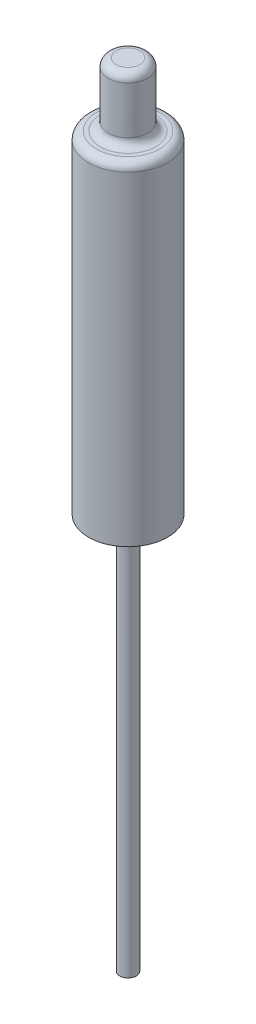
ISO-10303-21;
HEADER;
FILE_DESCRIPTION(('STEP AP214'),'2;1');
FILE_NAME('part.step','',(''),(''),'','','');
FILE_SCHEMA(('AUTOMOTIVE_DESIGN { 1 0 10303 214 1 1 1 1 }'));
ENDSEC;
DATA;
#1=APPLICATION_CONTEXT('core data for automotive mechanical design processes');
#2=APPLICATION_PROTOCOL_DEFINITION('international standard','automotive_design',2000,#1);
#3=PRODUCT_CONTEXT('',#1,'mechanical');
#4=PRODUCT('Part','Part','',(#3));
#5=PRODUCT_RELATED_PRODUCT_CATEGORY('part','',(#4));
#6=PRODUCT_DEFINITION_FORMATION('','',#4);
#7=PRODUCT_DEFINITION_CONTEXT('part definition',#1,'design');
#8=PRODUCT_DEFINITION('design','',#6,#7);
#9=PRODUCT_DEFINITION_SHAPE('','',#8);
#10=(LENGTH_UNIT() NAMED_UNIT(*) SI_UNIT(.MILLI.,.METRE.));
#11=(NAMED_UNIT(*) PLANE_ANGLE_UNIT() SI_UNIT($,.RADIAN.));
#12=(NAMED_UNIT(*) SI_UNIT($,.STERADIAN.) SOLID_ANGLE_UNIT());
#13=UNCERTAINTY_MEASURE_WITH_UNIT(LENGTH_MEASURE(1.E-05),#10,'distance_accuracy_value','');
#14=(GEOMETRIC_REPRESENTATION_CONTEXT(3) GLOBAL_UNCERTAINTY_ASSIGNED_CONTEXT((#13)) GLOBAL_UNIT_ASSIGNED_CONTEXT((#10,
#11,#12)) REPRESENTATION_CONTEXT('',''));
#15=CARTESIAN_POINT('',(0.,0.,0.));
#16=DIRECTION('',(0.,0.,1.));
#17=DIRECTION('',(1.,0.,0.));
#18=AXIS2_PLACEMENT_3D('',#15,#16,#17);
#19=CARTESIAN_POINT('',(0.,100.,0.));
#20=DIRECTION('',(0.,-1.,0.));
#21=DIRECTION('',(0.,0.,-1.));
#22=AXIS2_PLACEMENT_3D('',#19,#20,#21);
#23=CYLINDRICAL_SURFACE('',#22,1.05);
#24=CARTESIAN_POINT('',(0.,50.,0.));
#25=DIRECTION('',(0.,-1.,0.));
#26=DIRECTION('',(0.,0.,-1.));
#27=AXIS2_PLACEMENT_3D('',#24,#25,#26);
#28=CIRCLE('',#27,1.05);
#29=CARTESIAN_POINT('',(0.,50.,-1.05));
#30=VERTEX_POINT('',#29);
#31=EDGE_CURVE('E58',#30,#30,#28,.T.);
#32=ORIENTED_EDGE('',*,*,#31,.T.);
#33=EDGE_LOOP('',(#32));
#34=FACE_BOUND('',#33,.T.);
#35=CARTESIAN_POINT('',(0.,0.,0.));
#36=DIRECTION('',(0.,1.,0.));
#37=DIRECTION('',(0.,0.,1.));
#38=AXIS2_PLACEMENT_3D('',#35,#36,#37);
#39=CIRCLE('',#38,1.05);
#40=CARTESIAN_POINT('',(0.,0.,1.05));
#41=VERTEX_POINT('',#40);
#42=EDGE_CURVE('E57',#41,#41,#39,.T.);
#43=ORIENTED_EDGE('',*,*,#42,.T.);
#44=EDGE_LOOP('',(#43));
#45=FACE_BOUND('',#44,.T.);
#46=ADVANCED_FACE('F31',(#34,#45),#23,.T.);
#47=CARTESIAN_POINT('',(0.,0.,0.));
#48=DIRECTION('',(0.,1.,0.));
#49=DIRECTION('',(0.,0.,1.));
#50=AXIS2_PLACEMENT_3D('',#47,#48,#49);
#51=PLANE('',#50);
#52=ORIENTED_EDGE('',*,*,#42,.F.);
#53=EDGE_LOOP('',(#52));
#54=FACE_BOUND('',#53,.T.);
#55=ADVANCED_FACE('F81',(#54),#51,.F.);
#56=CARTESIAN_POINT('',(0.,50.,0.));
#57=DIRECTION('',(0.,-1.,0.));
#58=DIRECTION('',(0.,0.,-1.));
#59=AXIS2_PLACEMENT_3D('',#56,#57,#58);
#60=PLANE('',#59);
#61=CARTESIAN_POINT('',(0.,50.,0.));
#62=DIRECTION('',(0.,-1.,0.));
#63=DIRECTION('',(0.,0.,-1.));
#64=AXIS2_PLACEMENT_3D('',#61,#62,#63);
#65=CIRCLE('',#64,5.);
#66=CARTESIAN_POINT('',(0.,50.,-5.));
#67=VERTEX_POINT('',#66);
#68=EDGE_CURVE('E61',#67,#67,#65,.T.);
#69=ORIENTED_EDGE('',*,*,#68,.T.);
#70=EDGE_LOOP('',(#69));
#71=FACE_BOUND('',#70,.T.);
#72=ORIENTED_EDGE('',*,*,#31,.F.);
#73=EDGE_LOOP('',(#72));
#74=FACE_BOUND('',#73,.T.);
#75=ADVANCED_FACE('F67',(#71,#74),#60,.T.);
#76=CARTESIAN_POINT('',(0.,50.,0.));
#77=DIRECTION('',(0.,1.,0.));
#78=DIRECTION('',(0.,0.,1.));
#79=AXIS2_PLACEMENT_3D('',#76,#77,#78);
#80=CYLINDRICAL_SURFACE('',#79,5.);
#81=CARTESIAN_POINT('',(0.,91.,0.));
#82=DIRECTION('',(0.,-1.,0.));
#83=DIRECTION('',(0.,0.,-1.));
#84=AXIS2_PLACEMENT_3D('',#81,#82,#83);
#85=CIRCLE('',#84,5.);
#86=CARTESIAN_POINT('',(0.,91.,-5.));
#87=VERTEX_POINT('',#86);
#88=EDGE_CURVE('E46',#87,#87,#85,.T.);
#89=ORIENTED_EDGE('',*,*,#88,.T.);
#90=EDGE_LOOP('',(#89));
#91=FACE_BOUND('',#90,.T.);
#92=ORIENTED_EDGE('',*,*,#68,.F.);
#93=EDGE_LOOP('',(#92));
#94=FACE_BOUND('',#93,.T.);
#95=ADVANCED_FACE('F70',(#91,#94),#80,.T.);
#96=CARTESIAN_POINT('',(0.,92.,0.));
#97=DIRECTION('',(0.,-1.,0.));
#98=DIRECTION('',(0.,0.,-1.));
#99=AXIS2_PLACEMENT_3D('',#96,#97,#98);
#100=PLANE('',#99);
#101=CARTESIAN_POINT('',(0.,92.,0.));
#102=DIRECTION('',(0.,-1.,0.));
#103=DIRECTION('',(0.,0.,-1.));
#104=AXIS2_PLACEMENT_3D('',#101,#102,#103);
#105=CIRCLE('',#104,3.5);
#106=CARTESIAN_POINT('',(0.,92.,-3.5));
#107=VERTEX_POINT('',#106);
#108=EDGE_CURVE('E10',#107,#107,#105,.T.);
#109=ORIENTED_EDGE('',*,*,#108,.T.);
#110=EDGE_LOOP('',(#109));
#111=FACE_BOUND('',#110,.T.);
#112=CARTESIAN_POINT('',(0.,92.,0.));
#113=DIRECTION('',(0.,-1.,0.));
#114=DIRECTION('',(0.,0.,-1.));
#115=AXIS2_PLACEMENT_3D('',#112,#113,#114);
#116=CIRCLE('',#115,4.);
#117=CARTESIAN_POINT('',(0.,92.,-4.));
#118=VERTEX_POINT('',#117);
#119=EDGE_CURVE('E42',#118,#118,#116,.F.);
#120=ORIENTED_EDGE('',*,*,#119,.T.);
#121=EDGE_LOOP('',(#120));
#122=FACE_BOUND('',#121,.T.);
#123=ADVANCED_FACE('F72',(#111,#122),#100,.F.);
#124=CARTESIAN_POINT('',(0.,100.,0.));
#125=DIRECTION('',(0.,1.,0.));
#126=DIRECTION('',(0.,0.,1.));
#127=AXIS2_PLACEMENT_3D('',#124,#125,#126);
#128=PLANE('',#127);
#129=CARTESIAN_POINT('',(0.,100.,0.));
#130=DIRECTION('',(0.,1.,0.));
#131=DIRECTION('',(0.,0.,1.));
#132=AXIS2_PLACEMENT_3D('',#129,#130,#131);
#133=CIRCLE('',#132,1.5);
#134=CARTESIAN_POINT('',(0.,100.,1.5));
#135=VERTEX_POINT('',#134);
#136=EDGE_CURVE('E54',#135,#135,#133,.T.);
#137=ORIENTED_EDGE('',*,*,#136,.T.);
#138=EDGE_LOOP('',(#137));
#139=FACE_BOUND('',#138,.T.);
#140=ADVANCED_FACE('F79',(#139),#128,.T.);
#141=CARTESIAN_POINT('',(0.,92.,0.));
#142=DIRECTION('',(0.,1.,0.));
#143=DIRECTION('',(0.,0.,1.));
#144=AXIS2_PLACEMENT_3D('',#141,#142,#143);
#145=CYLINDRICAL_SURFACE('',#144,2.5);
#146=CARTESIAN_POINT('',(0.,93.,0.));
#147=DIRECTION('',(0.,-1.,0.));
#148=DIRECTION('',(0.,0.,-1.));
#149=AXIS2_PLACEMENT_3D('',#146,#147,#148);
#150=CIRCLE('',#149,2.5);
#151=CARTESIAN_POINT('',(0.,93.,-2.5));
#152=VERTEX_POINT('',#151);
#153=EDGE_CURVE('E38',#152,#152,#150,.F.);
#154=ORIENTED_EDGE('',*,*,#153,.T.);
#155=EDGE_LOOP('',(#154));
#156=FACE_BOUND('',#155,.T.);
#157=CARTESIAN_POINT('',(0.,99.,0.));
#158=DIRECTION('',(0.,1.,0.));
#159=DIRECTION('',(0.,0.,1.));
#160=AXIS2_PLACEMENT_3D('',#157,#158,#159);
#161=CIRCLE('',#160,2.5);
#162=CARTESIAN_POINT('',(0.,99.,2.5));
#163=VERTEX_POINT('',#162);
#164=EDGE_CURVE('E51',#163,#163,#161,.F.);
#165=ORIENTED_EDGE('',*,*,#164,.T.);
#166=EDGE_LOOP('',(#165));
#167=FACE_BOUND('',#166,.T.);
#168=ADVANCED_FACE('F98',(#156,#167),#145,.T.);
#169=CARTESIAN_POINT('',(0.,99.,0.));
#170=DIRECTION('',(0.,1.,0.));
#171=DIRECTION('',(0.,0.,1.));
#172=AXIS2_PLACEMENT_3D('',#169,#170,#171);
#173=TOROIDAL_SURFACE('',#172,1.5,1.);
#174=ORIENTED_EDGE('',*,*,#164,.F.);
#175=EDGE_LOOP('',(#174));
#176=FACE_BOUND('',#175,.T.);
#177=ORIENTED_EDGE('',*,*,#136,.F.);
#178=EDGE_LOOP('',(#177));
#179=FACE_BOUND('',#178,.T.);
#180=ADVANCED_FACE('F95',(#176,#179),#173,.T.);
#181=CARTESIAN_POINT('',(0.,91.,0.));
#182=DIRECTION('',(0.,-1.,0.));
#183=DIRECTION('',(0.,0.,-1.));
#184=AXIS2_PLACEMENT_3D('',#181,#182,#183);
#185=TOROIDAL_SURFACE('',#184,4.,1.);
#186=ORIENTED_EDGE('',*,*,#119,.F.);
#187=EDGE_LOOP('',(#186));
#188=FACE_BOUND('',#187,.T.);
#189=ORIENTED_EDGE('',*,*,#88,.F.);
#190=EDGE_LOOP('',(#189));
#191=FACE_BOUND('',#190,.T.);
#192=ADVANCED_FACE('F97',(#188,#191),#185,.T.);
#193=CARTESIAN_POINT('',(0.,93.,0.));
#194=DIRECTION('',(0.,-1.,0.));
#195=DIRECTION('',(0.,0.,-1.));
#196=AXIS2_PLACEMENT_3D('',#193,#194,#195);
#197=TOROIDAL_SURFACE('',#196,3.5,1.);
#198=ORIENTED_EDGE('',*,*,#108,.F.);
#199=EDGE_LOOP('',(#198));
#200=FACE_BOUND('',#199,.T.);
#201=ORIENTED_EDGE('',*,*,#153,.F.);
#202=EDGE_LOOP('',(#201));
#203=FACE_BOUND('',#202,.T.);
#204=ADVANCED_FACE('F33',(#200,#203),#197,.F.);
#205=CLOSED_SHELL('',(#46,#55,#75,#95,#123,#140,#168,#180,#192,#204));
#206=MANIFOLD_SOLID_BREP('B2',#205);
#207=ADVANCED_BREP_SHAPE_REPRESENTATION('',(#18,#206),#14);
#208=SHAPE_DEFINITION_REPRESENTATION(#9,#207);
ENDSEC;
END-ISO-10303-21;
